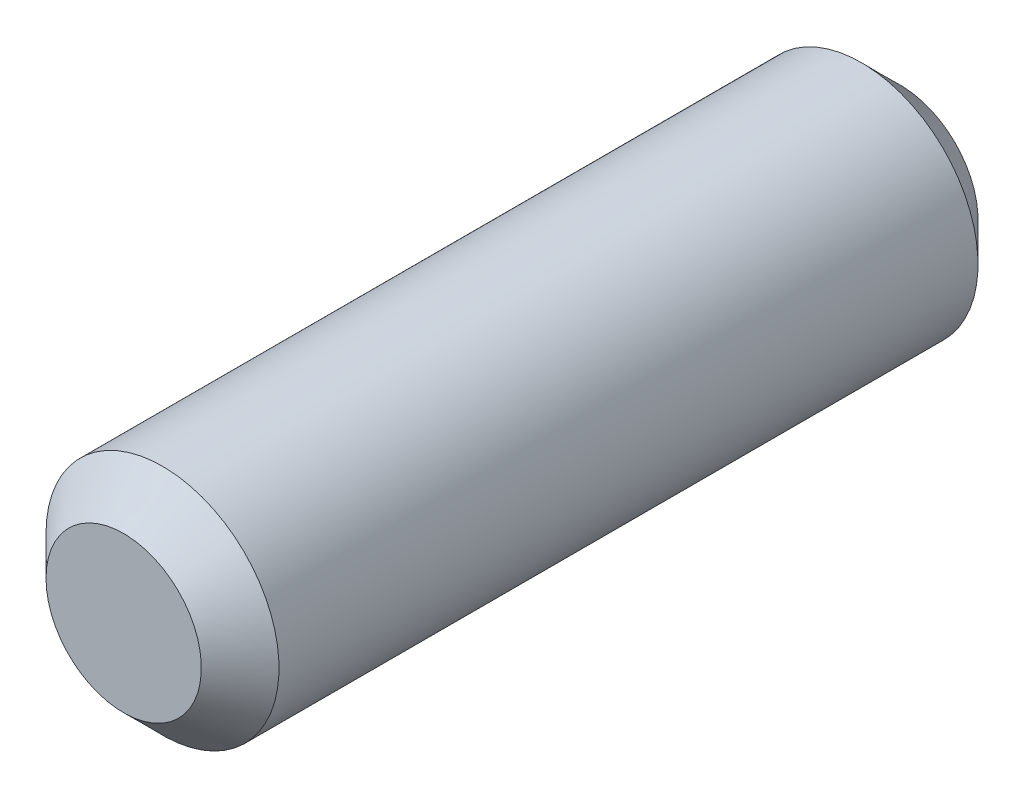
ISO-10303-21;
HEADER;
FILE_DESCRIPTION(('STEP AP214'),'2;1');
FILE_NAME('part.step','',(''),(''),'','','');
FILE_SCHEMA(('AUTOMOTIVE_DESIGN { 1 0 10303 214 1 1 1 1 }'));
ENDSEC;
DATA;
#1=APPLICATION_CONTEXT('core data for automotive mechanical design processes');
#2=APPLICATION_PROTOCOL_DEFINITION('international standard','automotive_design',2000,#1);
#3=PRODUCT_CONTEXT('',#1,'mechanical');
#4=PRODUCT('Part','Part','',(#3));
#5=PRODUCT_RELATED_PRODUCT_CATEGORY('part','',(#4));
#6=PRODUCT_DEFINITION_FORMATION('','',#4);
#7=PRODUCT_DEFINITION_CONTEXT('part definition',#1,'design');
#8=PRODUCT_DEFINITION('design','',#6,#7);
#9=PRODUCT_DEFINITION_SHAPE('','',#8);
#10=(LENGTH_UNIT() NAMED_UNIT(*) SI_UNIT(.MILLI.,.METRE.));
#11=(NAMED_UNIT(*) PLANE_ANGLE_UNIT() SI_UNIT($,.RADIAN.));
#12=(NAMED_UNIT(*) SI_UNIT($,.STERADIAN.) SOLID_ANGLE_UNIT());
#13=UNCERTAINTY_MEASURE_WITH_UNIT(LENGTH_MEASURE(1.E-05),#10,'distance_accuracy_value','');
#14=(GEOMETRIC_REPRESENTATION_CONTEXT(3) GLOBAL_UNCERTAINTY_ASSIGNED_CONTEXT((#13)) GLOBAL_UNIT_ASSIGNED_CONTEXT((#10,
#11,#12)) REPRESENTATION_CONTEXT('',''));
#15=CARTESIAN_POINT('',(0.,0.,0.));
#16=DIRECTION('',(0.,0.,1.));
#17=DIRECTION('',(1.,0.,0.));
#18=AXIS2_PLACEMENT_3D('',#15,#16,#17);
#19=CARTESIAN_POINT('',(0.,0.,10.));
#20=DIRECTION('',(0.,0.,-1.));
#21=DIRECTION('',(-1.,0.,0.));
#22=AXIS2_PLACEMENT_3D('',#19,#20,#21);
#23=CYLINDRICAL_SURFACE('',#22,1.5);
#24=CARTESIAN_POINT('',(0.,0.,9.5));
#25=DIRECTION('',(0.,0.,-1.));
#26=DIRECTION('',(-1.,0.,0.));
#27=AXIS2_PLACEMENT_3D('',#24,#25,#26);
#28=CIRCLE('',#27,1.5);
#29=CARTESIAN_POINT('',(-1.5,0.,9.5));
#30=VERTEX_POINT('',#29);
#31=EDGE_CURVE('E26',#30,#30,#28,.T.);
#32=ORIENTED_EDGE('',*,*,#31,.T.);
#33=EDGE_LOOP('',(#32));
#34=FACE_BOUND('',#33,.T.);
#35=CARTESIAN_POINT('',(0.,0.,0.5));
#36=DIRECTION('',(0.,0.,-1.));
#37=DIRECTION('',(-1.,0.,0.));
#38=AXIS2_PLACEMENT_3D('',#35,#36,#37);
#39=CIRCLE('',#38,1.5);
#40=CARTESIAN_POINT('',(-1.5,0.,0.5));
#41=VERTEX_POINT('',#40);
#42=EDGE_CURVE('E30',#41,#41,#39,.F.);
#43=ORIENTED_EDGE('',*,*,#42,.T.);
#44=EDGE_LOOP('',(#43));
#45=FACE_BOUND('',#44,.T.);
#46=ADVANCED_FACE('F15',(#34,#45),#23,.T.);
#47=CARTESIAN_POINT('',(0.,0.,10.));
#48=DIRECTION('',(0.,0.,-1.));
#49=DIRECTION('',(-1.,0.,0.));
#50=AXIS2_PLACEMENT_3D('',#47,#48,#49);
#51=PLANE('',#50);
#52=CARTESIAN_POINT('',(0.,0.,10.));
#53=DIRECTION('',(0.,0.,-1.));
#54=DIRECTION('',(-1.,0.,0.));
#55=AXIS2_PLACEMENT_3D('',#52,#53,#54);
#56=CIRCLE('',#55,1.);
#57=CARTESIAN_POINT('',(-1.,0.,10.));
#58=VERTEX_POINT('',#57);
#59=EDGE_CURVE('E22',#58,#58,#56,.F.);
#60=ORIENTED_EDGE('',*,*,#59,.T.);
#61=EDGE_LOOP('',(#60));
#62=FACE_BOUND('',#61,.T.);
#63=ADVANCED_FACE('F47',(#62),#51,.F.);
#64=CARTESIAN_POINT('',(0.,0.,0.));
#65=DIRECTION('',(0.,0.,-1.));
#66=DIRECTION('',(-1.,0.,0.));
#67=AXIS2_PLACEMENT_3D('',#64,#65,#66);
#68=PLANE('',#67);
#69=CARTESIAN_POINT('',(0.,0.,0.));
#70=DIRECTION('',(0.,0.,-1.));
#71=DIRECTION('',(-1.,0.,0.));
#72=AXIS2_PLACEMENT_3D('',#69,#70,#71);
#73=CIRCLE('',#72,1.);
#74=CARTESIAN_POINT('',(-1.,0.,0.));
#75=VERTEX_POINT('',#74);
#76=EDGE_CURVE('E10',#75,#75,#73,.T.);
#77=ORIENTED_EDGE('',*,*,#76,.T.);
#78=EDGE_LOOP('',(#77));
#79=FACE_BOUND('',#78,.T.);
#80=ADVANCED_FACE('F44',(#79),#68,.T.);
#81=CARTESIAN_POINT('',(0.,0.,9.5));
#82=DIRECTION('',(0.,0.,-1.));
#83=DIRECTION('',(-1.,0.,0.));
#84=AXIS2_PLACEMENT_3D('',#81,#82,#83);
#85=CONICAL_SURFACE('',#84,1.5,0.785398163397448);
#86=ORIENTED_EDGE('',*,*,#59,.F.);
#87=EDGE_LOOP('',(#86));
#88=FACE_BOUND('',#87,.T.);
#89=ORIENTED_EDGE('',*,*,#31,.F.);
#90=EDGE_LOOP('',(#89));
#91=FACE_BOUND('',#90,.T.);
#92=ADVANCED_FACE('F39',(#88,#91),#85,.T.);
#93=CARTESIAN_POINT('',(0.,0.,0.));
#94=DIRECTION('',(0.,0.,1.));
#95=DIRECTION('',(1.,0.,0.));
#96=AXIS2_PLACEMENT_3D('',#93,#94,#95);
#97=CONICAL_SURFACE('',#96,1.,0.785398163397448);
#98=ORIENTED_EDGE('',*,*,#42,.F.);
#99=EDGE_LOOP('',(#98));
#100=FACE_BOUND('',#99,.T.);
#101=ORIENTED_EDGE('',*,*,#76,.F.);
#102=EDGE_LOOP('',(#101));
#103=FACE_BOUND('',#102,.T.);
#104=ADVANCED_FACE('F17',(#100,#103),#97,.T.);
#105=CLOSED_SHELL('',(#46,#63,#80,#92,#104));
#106=MANIFOLD_SOLID_BREP('B1',#105);
#107=ADVANCED_BREP_SHAPE_REPRESENTATION('',(#18,#106),#14);
#108=SHAPE_DEFINITION_REPRESENTATION(#9,#107);
ENDSEC;
END-ISO-10303-21;
